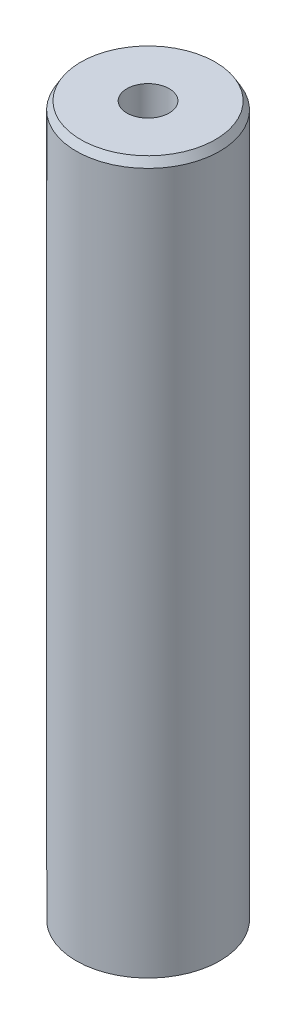
ISO-10303-21;
HEADER;
FILE_DESCRIPTION(('STEP AP214'),'2;1');
FILE_NAME('part.step','',(''),(''),'','','');
FILE_SCHEMA(('AUTOMOTIVE_DESIGN { 1 0 10303 214 1 1 1 1 }'));
ENDSEC;
DATA;
#1=APPLICATION_CONTEXT('core data for automotive mechanical design processes');
#2=APPLICATION_PROTOCOL_DEFINITION('international standard','automotive_design',2000,#1);
#3=PRODUCT_CONTEXT('',#1,'mechanical');
#4=PRODUCT('Part','Part','',(#3));
#5=PRODUCT_RELATED_PRODUCT_CATEGORY('part','',(#4));
#6=PRODUCT_DEFINITION_FORMATION('','',#4);
#7=PRODUCT_DEFINITION_CONTEXT('part definition',#1,'design');
#8=PRODUCT_DEFINITION('design','',#6,#7);
#9=PRODUCT_DEFINITION_SHAPE('','',#8);
#10=(LENGTH_UNIT() NAMED_UNIT(*) SI_UNIT(.MILLI.,.METRE.));
#11=(NAMED_UNIT(*) PLANE_ANGLE_UNIT() SI_UNIT($,.RADIAN.));
#12=(NAMED_UNIT(*) SI_UNIT($,.STERADIAN.) SOLID_ANGLE_UNIT());
#13=UNCERTAINTY_MEASURE_WITH_UNIT(LENGTH_MEASURE(1.E-05),#10,'distance_accuracy_value','');
#14=(GEOMETRIC_REPRESENTATION_CONTEXT(3) GLOBAL_UNCERTAINTY_ASSIGNED_CONTEXT((#13)) GLOBAL_UNIT_ASSIGNED_CONTEXT((#10,
#11,#12)) REPRESENTATION_CONTEXT('',''));
#15=CARTESIAN_POINT('',(0.,0.,0.));
#16=DIRECTION('',(0.,0.,1.));
#17=DIRECTION('',(1.,0.,0.));
#18=AXIS2_PLACEMENT_3D('',#15,#16,#17);
#19=CARTESIAN_POINT('',(0.,174.013878562012,0.));
#20=DIRECTION('',(0.,-1.,0.));
#21=DIRECTION('',(0.,0.,-1.));
#22=AXIS2_PLACEMENT_3D('',#19,#20,#21);
#23=CYLINDRICAL_SURFACE('',#22,17.5);
#24=CARTESIAN_POINT('',(0.,172.116991003471,0.));
#25=DIRECTION('',(0.,1.,0.));
#26=DIRECTION('',(0.,0.,1.));
#27=AXIS2_PLACEMENT_3D('',#24,#25,#26);
#28=CIRCLE('',#27,17.5);
#29=CARTESIAN_POINT('',(0.,172.116991003471,-17.5));
#30=VERTEX_POINT('',#29);
#31=EDGE_CURVE('E50',#30,#30,#28,.F.);
#32=ORIENTED_EDGE('',*,*,#31,.T.);
#33=EDGE_LOOP('',(#32));
#34=FACE_BOUND('',#33,.T.);
#35=CARTESIAN_POINT('',(0.,1.09516854254646,0.));
#36=DIRECTION('',(0.,1.,0.));
#37=DIRECTION('',(0.,0.,1.));
#38=AXIS2_PLACEMENT_3D('',#35,#36,#37);
#39=CIRCLE('',#38,17.5);
#40=CARTESIAN_POINT('',(0.,1.09516854254646,17.5));
#41=VERTEX_POINT('',#40);
#42=EDGE_CURVE('E51',#41,#41,#39,.T.);
#43=ORIENTED_EDGE('',*,*,#42,.T.);
#44=EDGE_LOOP('',(#43));
#45=FACE_BOUND('',#44,.T.);
#46=ADVANCED_FACE('F39',(#34,#45),#23,.T.);
#47=CARTESIAN_POINT('',(0.,174.013878562012,0.));
#48=DIRECTION('',(0.,1.,0.));
#49=DIRECTION('',(0.,0.,1.));
#50=AXIS2_PLACEMENT_3D('',#47,#48,#49);
#51=PLANE('',#50);
#52=CARTESIAN_POINT('',(0.,174.013878562012,0.));
#53=DIRECTION('',(0.,1.,0.));
#54=DIRECTION('',(0.,0.,1.));
#55=AXIS2_PLACEMENT_3D('',#52,#53,#54);
#56=CIRCLE('',#55,16.4048314574536);
#57=CARTESIAN_POINT('',(0.,174.013878562012,-16.4048314574536));
#58=VERTEX_POINT('',#57);
#59=EDGE_CURVE('E54',#58,#58,#56,.T.);
#60=ORIENTED_EDGE('',*,*,#59,.T.);
#61=EDGE_LOOP('',(#60));
#62=FACE_BOUND('',#61,.T.);
#63=CARTESIAN_POINT('',(0.,174.013878562012,0.));
#64=DIRECTION('',(0.,1.,0.));
#65=DIRECTION('',(0.,0.,1.));
#66=AXIS2_PLACEMENT_3D('',#63,#64,#65);
#67=CIRCLE('',#66,5.15844642498385);
#68=CARTESIAN_POINT('',(0.,174.013878562012,5.15844642498385));
#69=VERTEX_POINT('',#68);
#70=EDGE_CURVE('E58',#69,#69,#67,.T.);
#71=ORIENTED_EDGE('',*,*,#70,.F.);
#72=EDGE_LOOP('',(#71));
#73=FACE_BOUND('',#72,.T.);
#74=ADVANCED_FACE('F69',(#62,#73),#51,.T.);
#75=CARTESIAN_POINT('',(0.,0.,0.));
#76=DIRECTION('',(0.,1.,0.));
#77=DIRECTION('',(0.,0.,1.));
#78=AXIS2_PLACEMENT_3D('',#75,#76,#77);
#79=PLANE('',#78);
#80=CARTESIAN_POINT('',(0.,0.,0.));
#81=DIRECTION('',(0.,1.,0.));
#82=DIRECTION('',(0.,0.,1.));
#83=AXIS2_PLACEMENT_3D('',#80,#81,#82);
#84=CIRCLE('',#83,15.6031124414584);
#85=CARTESIAN_POINT('',(0.,0.,15.6031124414584));
#86=VERTEX_POINT('',#85);
#87=EDGE_CURVE('E10',#86,#86,#84,.F.);
#88=ORIENTED_EDGE('',*,*,#87,.T.);
#89=EDGE_LOOP('',(#88));
#90=FACE_BOUND('',#89,.T.);
#91=CARTESIAN_POINT('',(0.,0.,0.));
#92=DIRECTION('',(0.,1.,0.));
#93=DIRECTION('',(0.,0.,1.));
#94=AXIS2_PLACEMENT_3D('',#91,#92,#93);
#95=CIRCLE('',#94,5.15844642498385);
#96=CARTESIAN_POINT('',(0.,0.,5.15844642498385));
#97=VERTEX_POINT('',#96);
#98=EDGE_CURVE('E63',#97,#97,#95,.T.);
#99=ORIENTED_EDGE('',*,*,#98,.T.);
#100=EDGE_LOOP('',(#99));
#101=FACE_BOUND('',#100,.T.);
#102=ADVANCED_FACE('F75',(#90,#101),#79,.F.);
#103=CARTESIAN_POINT('',(0.,174.013878562012,0.));
#104=DIRECTION('',(0.,-1.,0.));
#105=DIRECTION('',(0.,0.,-1.));
#106=AXIS2_PLACEMENT_3D('',#103,#104,#105);
#107=CYLINDRICAL_SURFACE('',#106,5.15844642498385);
#108=ORIENTED_EDGE('',*,*,#70,.T.);
#109=EDGE_LOOP('',(#108));
#110=FACE_BOUND('',#109,.T.);
#111=ORIENTED_EDGE('',*,*,#98,.F.);
#112=EDGE_LOOP('',(#111));
#113=FACE_BOUND('',#112,.T.);
#114=ADVANCED_FACE('F70',(#110,#113),#107,.F.);
#115=CARTESIAN_POINT('',(0.,174.013878562012,0.));
#116=DIRECTION('',(0.,-1.,0.));
#117=DIRECTION('',(0.,0.,-1.));
#118=AXIS2_PLACEMENT_3D('',#115,#116,#117);
#119=CONICAL_SURFACE('',#118,16.4048314574536,0.523598775598303);
#120=CARTESIAN_POINT('',(0.,172.116991003471,-17.5));
#121=CARTESIAN_POINT('',(0.,172.136750248872,-17.4885919943485));
#122=CARTESIAN_POINT('',(0.,172.156509494274,-17.477183988697));
#123=CARTESIAN_POINT('',(0.,172.196027985077,-17.4543679773939));
#124=CARTESIAN_POINT('',(0.,172.215787230478,-17.4429599717424));
#125=CARTESIAN_POINT('',(0.,172.255305721281,-17.4201439604393));
#126=CARTESIAN_POINT('',(0.,172.275064966683,-17.4087359547878));
#127=CARTESIAN_POINT('',(0.,172.314583457486,-17.3859199434848));
#128=CARTESIAN_POINT('',(0.,172.334342702887,-17.3745119378332));
#129=CARTESIAN_POINT('',(0.,172.37386119369,-17.3516959265302));
#130=CARTESIAN_POINT('',(0.,172.393620439091,-17.3402879208787));
#131=CARTESIAN_POINT('',(0.,172.433138929894,-17.3174719095756));
#132=CARTESIAN_POINT('',(0.,172.452898175296,-17.3060639039241));
#133=CARTESIAN_POINT('',(0.,172.492416666099,-17.283247892621));
#134=CARTESIAN_POINT('',(0.,172.5121759115,-17.2718398869695));
#135=CARTESIAN_POINT('',(0.,172.551694402303,-17.2490238756665));
#136=CARTESIAN_POINT('',(0.,172.571453647705,-17.2376158700149));
#137=CARTESIAN_POINT('',(0.,172.610972138508,-17.2147998587119));
#138=CARTESIAN_POINT('',(0.,172.630731383909,-17.2033918530603));
#139=CARTESIAN_POINT('',(0.,172.670249874712,-17.1805758417573));
#140=CARTESIAN_POINT('',(0.,172.690009120114,-17.1691678361058));
#141=CARTESIAN_POINT('',(0.,172.729527610917,-17.1463518248027));
#142=CARTESIAN_POINT('',(0.,172.749286856318,-17.1349438191512));
#143=CARTESIAN_POINT('',(0.,172.788805347121,-17.1121278078481));
#144=CARTESIAN_POINT('',(0.,172.808564592522,-17.1007198021966));
#145=CARTESIAN_POINT('',(0.,172.848083083325,-17.0779037908936));
#146=CARTESIAN_POINT('',(0.,172.867842328727,-17.066495785242));
#147=CARTESIAN_POINT('',(0.,172.90736081953,-17.043679773939));
#148=CARTESIAN_POINT('',(0.,172.927120064931,-17.0322717682875));
#149=CARTESIAN_POINT('',(0.,172.966638555734,-17.0094557569844));
#150=CARTESIAN_POINT('',(0.,172.986397801136,-16.9980477513329));
#151=CARTESIAN_POINT('',(0.,173.025916291939,-16.9752317400298));
#152=CARTESIAN_POINT('',(0.,173.04567553734,-16.9638237343783));
#153=CARTESIAN_POINT('',(0.,173.085194028143,-16.9410077230753));
#154=CARTESIAN_POINT('',(0.,173.104953273545,-16.9295997174237));
#155=CARTESIAN_POINT('',(0.,173.144471764347,-16.9067837061207));
#156=CARTESIAN_POINT('',(0.,173.164231009749,-16.8953757004692));
#157=CARTESIAN_POINT('',(0.,173.203749500552,-16.8725596891661));
#158=CARTESIAN_POINT('',(0.,173.223508745953,-16.8611516835146));
#159=CARTESIAN_POINT('',(0.,173.263027236756,-16.8383356722115));
#160=CARTESIAN_POINT('',(0.,173.282786482158,-16.82692766656));
#161=CARTESIAN_POINT('',(0.,173.322304972961,-16.804111655257));
#162=CARTESIAN_POINT('',(0.,173.342064218362,-16.7927036496054));
#163=CARTESIAN_POINT('',(0.,173.381582709165,-16.7698876383024));
#164=CARTESIAN_POINT('',(0.,173.401341954567,-16.7584796326509));
#165=CARTESIAN_POINT('',(0.,173.44086044537,-16.7356636213478));
#166=CARTESIAN_POINT('',(0.,173.460619690771,-16.7242556156963));
#167=CARTESIAN_POINT('',(0.,173.500138181574,-16.7014396043932));
#168=CARTESIAN_POINT('',(0.,173.519897426975,-16.6900315987417));
#169=CARTESIAN_POINT('',(0.,173.559415917778,-16.6672155874387));
#170=CARTESIAN_POINT('',(0.,173.57917516318,-16.6558075817871));
#171=CARTESIAN_POINT('',(0.,173.618693653983,-16.6329915704841));
#172=CARTESIAN_POINT('',(0.,173.638452899384,-16.6215835648325));
#173=CARTESIAN_POINT('',(0.,173.677971390187,-16.5987675535295));
#174=CARTESIAN_POINT('',(0.,173.697730635589,-16.587359547878));
#175=CARTESIAN_POINT('',(0.,173.737249126392,-16.5645435365749));
#176=CARTESIAN_POINT('',(0.,173.757008371793,-16.5531355309234));
#177=CARTESIAN_POINT('',(0.,173.796526862596,-16.5303195196203));
#178=CARTESIAN_POINT('',(0.,173.816286107998,-16.5189115139688));
#179=CARTESIAN_POINT('',(0.,173.855804598801,-16.4960955026658));
#180=CARTESIAN_POINT('',(0.,173.875563844202,-16.4846874970142));
#181=CARTESIAN_POINT('',(0.,173.915082335005,-16.4618714857112));
#182=CARTESIAN_POINT('',(0.,173.934841580406,-16.4504634800597));
#183=CARTESIAN_POINT('',(0.,173.974360071209,-16.4276474687566));
#184=CARTESIAN_POINT('',(0.,173.994119316611,-16.4162394631051));
#185=CARTESIAN_POINT('',(0.,174.013878562012,-16.4048314574536));
#186=B_SPLINE_CURVE_WITH_KNOTS('',3,(#120,#121,#122,#123,#124,#125,#126,#127,#128,#129,#130,
#131,#132,#133,#134,#135,#136,#137,#138,#139,#140,#141,#142,#143,#144,#145,#146,#147,#148,#149,
#150,#151,#152,#153,#154,#155,#156,#157,#158,#159,#160,#161,#162,#163,#164,#165,#166,#167,#168,
#169,#170,#171,#172,#173,#174,#175,#176,#177,#178,#179,#180,#181,#182,#183,#184,#185),
.UNSPECIFIED.,.F.,.F.,(4,2,2,2,2,2,2,2,2,2,2,2,2,2,2,2,2,2,2,2,2,2,2,2,2,2,2,2,2,2,2,2,4),(0.,
0.0684480339091305,0.136896067818285,0.20534410172744,0.273792135636594,0.342240169545749,
0.410688203454905,0.479136237364059,0.547584271273214,0.616032305182368,0.684480339091523,
0.752928373000653,0.82137640690981,0.889824440818964,0.958272474728118,1.02672050863727,
1.09516854254643,1.16361657645558,1.23206461036474,1.30051264427389,1.36896067818305,
1.4374087120922,1.50585674600133,1.57430477991049,1.64275281381964,1.7112008477288,
1.77964888163795,1.84809691554711,1.91654494945626,1.98499298336542,2.05344101727457,
2.12188905118373,2.19033708509288),.UNSPECIFIED.);
#187=EDGE_CURVE('BSEAM81',#30,#58,#186,.T.);
#188=ORIENTED_EDGE('',*,*,#31,.F.);
#189=ORIENTED_EDGE('',*,*,#59,.F.);
#190=ORIENTED_EDGE('',*,*,#187,.T.);
#191=ORIENTED_EDGE('',*,*,#187,.F.);
#192=EDGE_LOOP('',(#188,#190,#189,#191));
#193=FACE_BOUND('',#192,.T.);
#194=ADVANCED_FACE('F81',(#193),#119,.T.);
#195=CARTESIAN_POINT('',(0.,1.09516854254646,0.));
#196=DIRECTION('',(0.,1.,0.));
#197=DIRECTION('',(0.,0.,1.));
#198=AXIS2_PLACEMENT_3D('',#195,#196,#197);
#199=CONICAL_SURFACE('',#198,17.5,1.0471975511966);
#200=ORIENTED_EDGE('',*,*,#87,.F.);
#201=EDGE_LOOP('',(#200));
#202=FACE_BOUND('',#201,.T.);
#203=ORIENTED_EDGE('',*,*,#42,.F.);
#204=EDGE_LOOP('',(#203));
#205=FACE_BOUND('',#204,.T.);
#206=ADVANCED_FACE('F45',(#202,#205),#199,.T.);
#207=CLOSED_SHELL('',(#46,#74,#102,#114,#194,#206));
#208=MANIFOLD_SOLID_BREP('B2',#207);
#209=ADVANCED_BREP_SHAPE_REPRESENTATION('',(#18,#208),#14);
#210=SHAPE_DEFINITION_REPRESENTATION(#9,#209);
ENDSEC;
END-ISO-10303-21;
